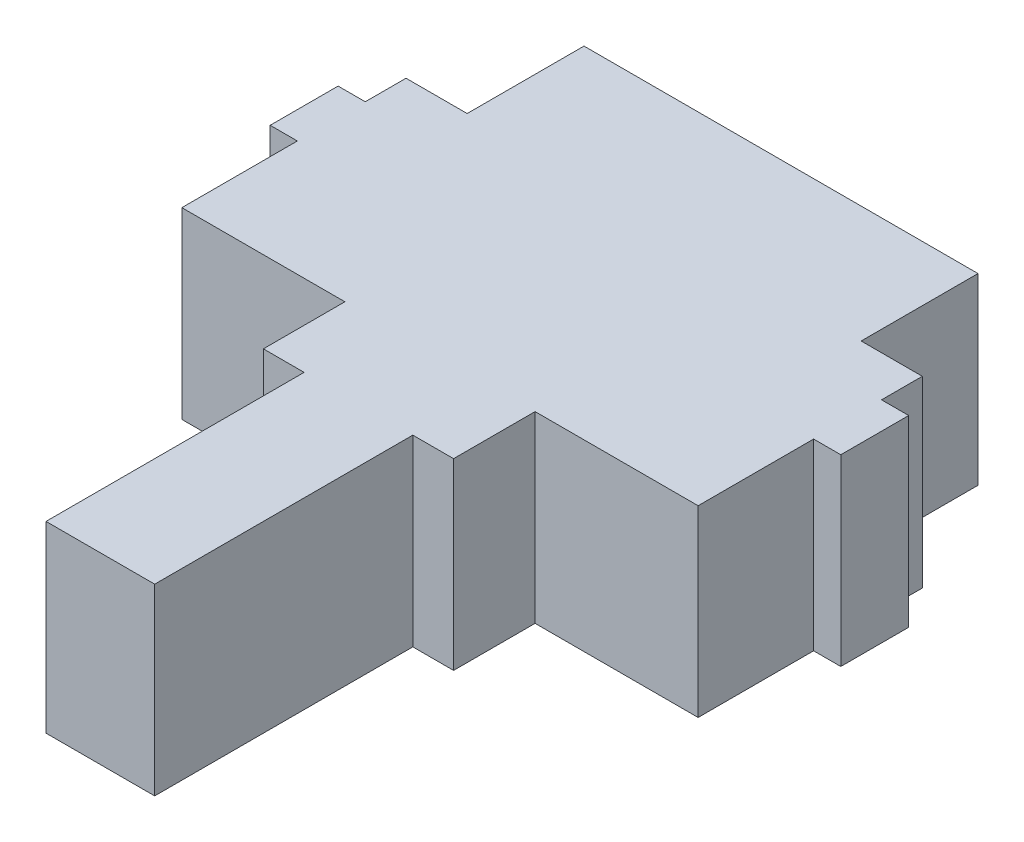
ISO-10303-21;
HEADER;
FILE_DESCRIPTION(('STEP AP214'),'2;1');
FILE_NAME('part.step','',(''),(''),'','','');
FILE_SCHEMA(('AUTOMOTIVE_DESIGN { 1 0 10303 214 1 1 1 1 }'));
ENDSEC;
DATA;
#1=APPLICATION_CONTEXT('core data for automotive mechanical design processes');
#2=APPLICATION_PROTOCOL_DEFINITION('international standard','automotive_design',2000,#1);
#3=PRODUCT_CONTEXT('',#1,'mechanical');
#4=PRODUCT('Part','Part','',(#3));
#5=PRODUCT_RELATED_PRODUCT_CATEGORY('part','',(#4));
#6=PRODUCT_DEFINITION_FORMATION('','',#4);
#7=PRODUCT_DEFINITION_CONTEXT('part definition',#1,'design');
#8=PRODUCT_DEFINITION('design','',#6,#7);
#9=PRODUCT_DEFINITION_SHAPE('','',#8);
#10=(LENGTH_UNIT() NAMED_UNIT(*) SI_UNIT(.MILLI.,.METRE.));
#11=(NAMED_UNIT(*) PLANE_ANGLE_UNIT() SI_UNIT($,.RADIAN.));
#12=(NAMED_UNIT(*) SI_UNIT($,.STERADIAN.) SOLID_ANGLE_UNIT());
#13=UNCERTAINTY_MEASURE_WITH_UNIT(LENGTH_MEASURE(1.E-05),#10,'distance_accuracy_value','');
#14=(GEOMETRIC_REPRESENTATION_CONTEXT(3) GLOBAL_UNCERTAINTY_ASSIGNED_CONTEXT((#13)) GLOBAL_UNIT_ASSIGNED_CONTEXT((#10,
#11,#12)) REPRESENTATION_CONTEXT('',''));
#15=CARTESIAN_POINT('',(0.,0.,0.));
#16=DIRECTION('',(0.,0.,1.));
#17=DIRECTION('',(1.,0.,0.));
#18=AXIS2_PLACEMENT_3D('',#15,#16,#17);
#19=CARTESIAN_POINT('',(0.,13.5,-54.5939349107113));
#20=DIRECTION('',(0.,0.,-1.));
#21=DIRECTION('',(-1.,0.,0.));
#22=AXIS2_PLACEMENT_3D('',#19,#20,#21);
#23=PLANE('',#22);
#24=DIRECTION('',(1.,0.,0.));
#25=VECTOR('',#24,1.);
#26=CARTESIAN_POINT('',(0.,0.,-54.5939349107113));
#27=LINE('',#26,#25);
#28=CARTESIAN_POINT('',(19.5666079787848,0.,-54.5939349107113));
#29=VERTEX_POINT('',#28);
#30=CARTESIAN_POINT('',(48.5666079787848,0.,-54.5939349107113));
#31=VERTEX_POINT('',#30);
#32=EDGE_CURVE('E223',#29,#31,#27,.T.);
#33=ORIENTED_EDGE('',*,*,#32,.F.);
#34=DIRECTION('',(0.,-1.,0.));
#35=VECTOR('',#34,1.);
#36=CARTESIAN_POINT('',(19.5666079787848,13.5,-54.5939349107113));
#37=LINE('',#36,#35);
#38=CARTESIAN_POINT('',(19.5666079787848,13.5,-54.5939349107113));
#39=VERTEX_POINT('',#38);
#40=EDGE_CURVE('E43',#39,#29,#37,.T.);
#41=ORIENTED_EDGE('',*,*,#40,.F.);
#42=DIRECTION('',(1.,0.,0.));
#43=VECTOR('',#42,1.);
#44=CARTESIAN_POINT('',(0.,13.5,-54.5939349107113));
#45=LINE('',#44,#43);
#46=CARTESIAN_POINT('',(48.5666079787848,13.5,-54.5939349107113));
#47=VERTEX_POINT('',#46);
#48=EDGE_CURVE('E285',#39,#47,#45,.T.);
#49=ORIENTED_EDGE('',*,*,#48,.T.);
#50=DIRECTION('',(0.,-1.,0.));
#51=VECTOR('',#50,1.);
#52=CARTESIAN_POINT('',(48.5666079787848,13.5,-54.5939349107113));
#53=LINE('',#52,#51);
#54=EDGE_CURVE('E135',#47,#31,#53,.T.);
#55=ORIENTED_EDGE('',*,*,#54,.T.);
#56=EDGE_LOOP('',(#33,#41,#49,#55));
#57=FACE_BOUND('',#56,.T.);
#58=ADVANCED_FACE('F35',(#57),#23,.T.);
#59=CARTESIAN_POINT('',(19.5666079787848,13.5,0.));
#60=DIRECTION('',(-1.,0.,0.));
#61=DIRECTION('',(0.,0.,1.));
#62=AXIS2_PLACEMENT_3D('',#59,#60,#61);
#63=PLANE('',#62);
#64=DIRECTION('',(0.,0.,-1.));
#65=VECTOR('',#64,1.);
#66=CARTESIAN_POINT('',(19.5666079787848,0.,0.));
#67=LINE('',#66,#65);
#68=CARTESIAN_POINT('',(19.5666079787848,0.,-45.9939349107113));
#69=VERTEX_POINT('',#68);
#70=EDGE_CURVE('E226',#69,#29,#67,.T.);
#71=ORIENTED_EDGE('',*,*,#70,.F.);
#72=DIRECTION('',(0.,-1.,0.));
#73=VECTOR('',#72,1.);
#74=CARTESIAN_POINT('',(19.5666079787848,13.5,-45.9939349107113));
#75=LINE('',#74,#73);
#76=CARTESIAN_POINT('',(19.5666079787848,13.5,-45.9939349107113));
#77=VERTEX_POINT('',#76);
#78=EDGE_CURVE('E331',#77,#69,#75,.T.);
#79=ORIENTED_EDGE('',*,*,#78,.F.);
#80=DIRECTION('',(0.,0.,-1.));
#81=VECTOR('',#80,1.);
#82=CARTESIAN_POINT('',(19.5666079787848,13.5,0.));
#83=LINE('',#82,#81);
#84=EDGE_CURVE('E337',#77,#39,#83,.T.);
#85=ORIENTED_EDGE('',*,*,#84,.T.);
#86=ORIENTED_EDGE('',*,*,#40,.T.);
#87=EDGE_LOOP('',(#71,#79,#85,#86));
#88=FACE_BOUND('',#87,.T.);
#89=ADVANCED_FACE('F335',(#88),#63,.T.);
#90=CARTESIAN_POINT('',(1.41843126474952E-13,13.5,-45.9939349107114));
#91=DIRECTION('',(0.,0.,-1.));
#92=DIRECTION('',(-1.,0.,0.));
#93=AXIS2_PLACEMENT_3D('',#90,#91,#92);
#94=PLANE('',#93);
#95=DIRECTION('',(1.,0.,0.));
#96=VECTOR('',#95,1.);
#97=CARTESIAN_POINT('',(1.41843126474952E-13,0.,-45.9939349107114));
#98=LINE('',#97,#96);
#99=CARTESIAN_POINT('',(15.0666079787848,0.,-45.9939349107113));
#100=VERTEX_POINT('',#99);
#101=EDGE_CURVE('E230',#100,#69,#98,.T.);
#102=ORIENTED_EDGE('',*,*,#101,.F.);
#103=DIRECTION('',(0.,-1.,0.));
#104=VECTOR('',#103,1.);
#105=CARTESIAN_POINT('',(15.0666079787848,13.5,-45.9939349107113));
#106=LINE('',#105,#104);
#107=CARTESIAN_POINT('',(15.0666079787848,13.5,-45.9939349107113));
#108=VERTEX_POINT('',#107);
#109=EDGE_CURVE('E329',#108,#100,#106,.T.);
#110=ORIENTED_EDGE('',*,*,#109,.F.);
#111=DIRECTION('',(1.,0.,0.));
#112=VECTOR('',#111,1.);
#113=CARTESIAN_POINT('',(1.41843126474952E-13,13.5,-45.9939349107114));
#114=LINE('',#113,#112);
#115=EDGE_CURVE('E348',#108,#77,#114,.T.);
#116=ORIENTED_EDGE('',*,*,#115,.T.);
#117=ORIENTED_EDGE('',*,*,#78,.T.);
#118=EDGE_LOOP('',(#102,#110,#116,#117));
#119=FACE_BOUND('',#118,.T.);
#120=ADVANCED_FACE('F345',(#119),#94,.T.);
#121=CARTESIAN_POINT('',(15.0666079787848,13.5,0.));
#122=DIRECTION('',(-1.,0.,0.));
#123=DIRECTION('',(0.,0.,1.));
#124=AXIS2_PLACEMENT_3D('',#121,#122,#123);
#125=PLANE('',#124);
#126=DIRECTION('',(0.,0.,-1.));
#127=VECTOR('',#126,1.);
#128=CARTESIAN_POINT('',(15.0666079787848,0.,0.));
#129=LINE('',#128,#127);
#130=CARTESIAN_POINT('',(15.0666079787848,0.,-42.9939349107113));
#131=VERTEX_POINT('',#130);
#132=EDGE_CURVE('E233',#131,#100,#129,.T.);
#133=ORIENTED_EDGE('',*,*,#132,.F.);
#134=DIRECTION('',(0.,-1.,0.));
#135=VECTOR('',#134,1.);
#136=CARTESIAN_POINT('',(15.0666079787848,13.5,-42.9939349107113));
#137=LINE('',#136,#135);
#138=CARTESIAN_POINT('',(15.0666079787848,13.5,-42.9939349107113));
#139=VERTEX_POINT('',#138);
#140=EDGE_CURVE('E327',#139,#131,#137,.T.);
#141=ORIENTED_EDGE('',*,*,#140,.F.);
#142=DIRECTION('',(0.,0.,-1.));
#143=VECTOR('',#142,1.);
#144=CARTESIAN_POINT('',(15.0666079787848,13.5,0.));
#145=LINE('',#144,#143);
#146=EDGE_CURVE('E352',#139,#108,#145,.T.);
#147=ORIENTED_EDGE('',*,*,#146,.T.);
#148=ORIENTED_EDGE('',*,*,#109,.T.);
#149=EDGE_LOOP('',(#133,#141,#147,#148));
#150=FACE_BOUND('',#149,.T.);
#151=ADVANCED_FACE('F419',(#150),#125,.T.);
#152=CARTESIAN_POINT('',(2.98330352856919E-13,13.5,-42.9939349107114));
#153=DIRECTION('',(0.,0.,1.));
#154=DIRECTION('',(1.,0.,0.));
#155=AXIS2_PLACEMENT_3D('',#152,#153,#154);
#156=PLANE('',#155);
#157=DIRECTION('',(-1.,0.,0.));
#158=VECTOR('',#157,1.);
#159=CARTESIAN_POINT('',(2.98330352856919E-13,0.,-42.9939349107114));
#160=LINE('',#159,#158);
#161=CARTESIAN_POINT('',(13.0666079787848,0.,-42.9939349107113));
#162=VERTEX_POINT('',#161);
#163=EDGE_CURVE('E236',#131,#162,#160,.T.);
#164=ORIENTED_EDGE('',*,*,#163,.T.);
#165=DIRECTION('',(0.,-1.,0.));
#166=VECTOR('',#165,1.);
#167=CARTESIAN_POINT('',(13.0666079787848,13.5,-42.9939349107113));
#168=LINE('',#167,#166);
#169=CARTESIAN_POINT('',(13.0666079787848,13.5,-42.9939349107113));
#170=VERTEX_POINT('',#169);
#171=EDGE_CURVE('E325',#170,#162,#168,.T.);
#172=ORIENTED_EDGE('',*,*,#171,.F.);
#173=DIRECTION('',(-1.,0.,0.));
#174=VECTOR('',#173,1.);
#175=CARTESIAN_POINT('',(2.98330352856919E-13,13.5,-42.9939349107114));
#176=LINE('',#175,#174);
#177=EDGE_CURVE('E358',#139,#170,#176,.T.);
#178=ORIENTED_EDGE('',*,*,#177,.F.);
#179=ORIENTED_EDGE('',*,*,#140,.T.);
#180=EDGE_LOOP('',(#164,#172,#178,#179));
#181=FACE_BOUND('',#180,.T.);
#182=ADVANCED_FACE('F424',(#181),#156,.F.);
#183=CARTESIAN_POINT('',(13.0666079787848,13.5,0.));
#184=DIRECTION('',(-1.,0.,0.));
#185=DIRECTION('',(0.,0.,1.));
#186=AXIS2_PLACEMENT_3D('',#183,#184,#185);
#187=PLANE('',#186);
#188=DIRECTION('',(0.,0.,-1.));
#189=VECTOR('',#188,1.);
#190=CARTESIAN_POINT('',(13.0666079787848,0.,0.));
#191=LINE('',#190,#189);
#192=CARTESIAN_POINT('',(13.0666079787848,0.,-37.9939349107113));
#193=VERTEX_POINT('',#192);
#194=EDGE_CURVE('E239',#193,#162,#191,.T.);
#195=ORIENTED_EDGE('',*,*,#194,.F.);
#196=DIRECTION('',(0.,-1.,0.));
#197=VECTOR('',#196,1.);
#198=CARTESIAN_POINT('',(13.0666079787848,13.5,-37.9939349107113));
#199=LINE('',#198,#197);
#200=CARTESIAN_POINT('',(13.0666079787848,13.5,-37.9939349107113));
#201=VERTEX_POINT('',#200);
#202=EDGE_CURVE('E323',#201,#193,#199,.T.);
#203=ORIENTED_EDGE('',*,*,#202,.F.);
#204=DIRECTION('',(0.,0.,-1.));
#205=VECTOR('',#204,1.);
#206=CARTESIAN_POINT('',(13.0666079787848,13.5,0.));
#207=LINE('',#206,#205);
#208=EDGE_CURVE('E360',#201,#170,#207,.T.);
#209=ORIENTED_EDGE('',*,*,#208,.T.);
#210=ORIENTED_EDGE('',*,*,#171,.T.);
#211=EDGE_LOOP('',(#195,#203,#209,#210));
#212=FACE_BOUND('',#211,.T.);
#213=ADVANCED_FACE('F428',(#212),#187,.T.);
#214=CARTESIAN_POINT('',(0.,13.5,-37.9939349107113));
#215=DIRECTION('',(0.,0.,1.));
#216=DIRECTION('',(1.,0.,0.));
#217=AXIS2_PLACEMENT_3D('',#214,#215,#216);
#218=PLANE('',#217);
#219=DIRECTION('',(-1.,0.,0.));
#220=VECTOR('',#219,1.);
#221=CARTESIAN_POINT('',(0.,0.,-37.9939349107113));
#222=LINE('',#221,#220);
#223=CARTESIAN_POINT('',(15.0666079787848,0.,-37.9939349107113));
#224=VERTEX_POINT('',#223);
#225=EDGE_CURVE('E242',#224,#193,#222,.T.);
#226=ORIENTED_EDGE('',*,*,#225,.F.);
#227=DIRECTION('',(0.,-1.,0.));
#228=VECTOR('',#227,1.);
#229=CARTESIAN_POINT('',(15.0666079787848,13.5,-37.9939349107113));
#230=LINE('',#229,#228);
#231=CARTESIAN_POINT('',(15.0666079787848,13.5,-37.9939349107113));
#232=VERTEX_POINT('',#231);
#233=EDGE_CURVE('E321',#232,#224,#230,.T.);
#234=ORIENTED_EDGE('',*,*,#233,.F.);
#235=DIRECTION('',(-1.,0.,0.));
#236=VECTOR('',#235,1.);
#237=CARTESIAN_POINT('',(0.,13.5,-37.9939349107113));
#238=LINE('',#237,#236);
#239=EDGE_CURVE('E363',#232,#201,#238,.T.);
#240=ORIENTED_EDGE('',*,*,#239,.T.);
#241=ORIENTED_EDGE('',*,*,#202,.T.);
#242=EDGE_LOOP('',(#226,#234,#240,#241));
#243=FACE_BOUND('',#242,.T.);
#244=ADVANCED_FACE('F432',(#243),#218,.T.);
#245=CARTESIAN_POINT('',(15.0666079787848,13.5,0.));
#246=DIRECTION('',(-1.,0.,0.));
#247=DIRECTION('',(0.,0.,1.));
#248=AXIS2_PLACEMENT_3D('',#245,#246,#247);
#249=PLANE('',#248);
#250=DIRECTION('',(0.,0.,-1.));
#251=VECTOR('',#250,1.);
#252=CARTESIAN_POINT('',(15.0666079787848,0.,0.));
#253=LINE('',#252,#251);
#254=CARTESIAN_POINT('',(15.0666079787848,0.,-29.4939349107113));
#255=VERTEX_POINT('',#254);
#256=EDGE_CURVE('E245',#255,#224,#253,.T.);
#257=ORIENTED_EDGE('',*,*,#256,.F.);
#258=DIRECTION('',(0.,-1.,0.));
#259=VECTOR('',#258,1.);
#260=CARTESIAN_POINT('',(15.0666079787848,13.5,-29.4939349107113));
#261=LINE('',#260,#259);
#262=CARTESIAN_POINT('',(15.0666079787848,13.5,-29.4939349107113));
#263=VERTEX_POINT('',#262);
#264=EDGE_CURVE('E319',#263,#255,#261,.T.);
#265=ORIENTED_EDGE('',*,*,#264,.F.);
#266=DIRECTION('',(0.,0.,-1.));
#267=VECTOR('',#266,1.);
#268=CARTESIAN_POINT('',(15.0666079787848,13.5,0.));
#269=LINE('',#268,#267);
#270=EDGE_CURVE('E366',#263,#232,#269,.T.);
#271=ORIENTED_EDGE('',*,*,#270,.T.);
#272=ORIENTED_EDGE('',*,*,#233,.T.);
#273=EDGE_LOOP('',(#257,#265,#271,#272));
#274=FACE_BOUND('',#273,.T.);
#275=ADVANCED_FACE('F436',(#274),#249,.T.);
#276=CARTESIAN_POINT('',(0.,13.5,-29.4939349107113));
#277=DIRECTION('',(0.,0.,1.));
#278=DIRECTION('',(1.,0.,0.));
#279=AXIS2_PLACEMENT_3D('',#276,#277,#278);
#280=PLANE('',#279);
#281=DIRECTION('',(-1.,0.,0.));
#282=VECTOR('',#281,1.);
#283=CARTESIAN_POINT('',(0.,0.,-29.4939349107113));
#284=LINE('',#283,#282);
#285=CARTESIAN_POINT('',(27.0666079787848,0.,-29.4939349107113));
#286=VERTEX_POINT('',#285);
#287=EDGE_CURVE('E248',#286,#255,#284,.T.);
#288=ORIENTED_EDGE('',*,*,#287,.F.);
#289=DIRECTION('',(0.,-1.,0.));
#290=VECTOR('',#289,1.);
#291=CARTESIAN_POINT('',(27.0666079787848,13.5,-29.4939349107113));
#292=LINE('',#291,#290);
#293=CARTESIAN_POINT('',(27.0666079787848,13.5,-29.4939349107113));
#294=VERTEX_POINT('',#293);
#295=EDGE_CURVE('E317',#294,#286,#292,.T.);
#296=ORIENTED_EDGE('',*,*,#295,.F.);
#297=DIRECTION('',(-1.,0.,0.));
#298=VECTOR('',#297,1.);
#299=CARTESIAN_POINT('',(0.,13.5,-29.4939349107113));
#300=LINE('',#299,#298);
#301=EDGE_CURVE('E369',#294,#263,#300,.T.);
#302=ORIENTED_EDGE('',*,*,#301,.T.);
#303=ORIENTED_EDGE('',*,*,#264,.T.);
#304=EDGE_LOOP('',(#288,#296,#302,#303));
#305=FACE_BOUND('',#304,.T.);
#306=ADVANCED_FACE('F440',(#305),#280,.T.);
#307=CARTESIAN_POINT('',(27.0666079787848,13.5,0.));
#308=DIRECTION('',(-1.,0.,0.));
#309=DIRECTION('',(0.,0.,1.));
#310=AXIS2_PLACEMENT_3D('',#307,#308,#309);
#311=PLANE('',#310);
#312=DIRECTION('',(0.,0.,-1.));
#313=VECTOR('',#312,1.);
#314=CARTESIAN_POINT('',(27.0666079787848,0.,0.));
#315=LINE('',#314,#313);
#316=CARTESIAN_POINT('',(27.0666079787848,0.,-23.4939349107113));
#317=VERTEX_POINT('',#316);
#318=EDGE_CURVE('E251',#317,#286,#315,.T.);
#319=ORIENTED_EDGE('',*,*,#318,.F.);
#320=DIRECTION('',(0.,-1.,0.));
#321=VECTOR('',#320,1.);
#322=CARTESIAN_POINT('',(27.0666079787848,13.5,-23.4939349107113));
#323=LINE('',#322,#321);
#324=CARTESIAN_POINT('',(27.0666079787848,13.5,-23.4939349107113));
#325=VERTEX_POINT('',#324);
#326=EDGE_CURVE('E315',#325,#317,#323,.T.);
#327=ORIENTED_EDGE('',*,*,#326,.F.);
#328=DIRECTION('',(0.,0.,-1.));
#329=VECTOR('',#328,1.);
#330=CARTESIAN_POINT('',(27.0666079787848,13.5,0.));
#331=LINE('',#330,#329);
#332=EDGE_CURVE('E372',#325,#294,#331,.T.);
#333=ORIENTED_EDGE('',*,*,#332,.T.);
#334=ORIENTED_EDGE('',*,*,#295,.T.);
#335=EDGE_LOOP('',(#319,#327,#333,#334));
#336=FACE_BOUND('',#335,.T.);
#337=ADVANCED_FACE('F444',(#336),#311,.T.);
#338=CARTESIAN_POINT('',(0.,13.5,-23.4939349107113));
#339=DIRECTION('',(0.,0.,1.));
#340=DIRECTION('',(1.,0.,0.));
#341=AXIS2_PLACEMENT_3D('',#338,#339,#340);
#342=PLANE('',#341);
#343=DIRECTION('',(-1.,0.,0.));
#344=VECTOR('',#343,1.);
#345=CARTESIAN_POINT('',(0.,0.,-23.4939349107113));
#346=LINE('',#345,#344);
#347=CARTESIAN_POINT('',(30.0666079787848,0.,-23.4939349107113));
#348=VERTEX_POINT('',#347);
#349=EDGE_CURVE('E254',#348,#317,#346,.T.);
#350=ORIENTED_EDGE('',*,*,#349,.F.);
#351=DIRECTION('',(0.,-1.,0.));
#352=VECTOR('',#351,1.);
#353=CARTESIAN_POINT('',(30.0666079787848,13.5,-23.4939349107113));
#354=LINE('',#353,#352);
#355=CARTESIAN_POINT('',(30.0666079787848,13.5,-23.4939349107113));
#356=VERTEX_POINT('',#355);
#357=EDGE_CURVE('E313',#356,#348,#354,.T.);
#358=ORIENTED_EDGE('',*,*,#357,.F.);
#359=DIRECTION('',(-1.,0.,0.));
#360=VECTOR('',#359,1.);
#361=CARTESIAN_POINT('',(0.,13.5,-23.4939349107113));
#362=LINE('',#361,#360);
#363=EDGE_CURVE('E375',#356,#325,#362,.T.);
#364=ORIENTED_EDGE('',*,*,#363,.T.);
#365=ORIENTED_EDGE('',*,*,#326,.T.);
#366=EDGE_LOOP('',(#350,#358,#364,#365));
#367=FACE_BOUND('',#366,.T.);
#368=ADVANCED_FACE('F448',(#367),#342,.T.);
#369=CARTESIAN_POINT('',(30.0666079787848,13.5,0.));
#370=DIRECTION('',(1.,0.,0.));
#371=DIRECTION('',(0.,0.,-1.));
#372=AXIS2_PLACEMENT_3D('',#369,#370,#371);
#373=PLANE('',#372);
#374=DIRECTION('',(0.,0.,1.));
#375=VECTOR('',#374,1.);
#376=CARTESIAN_POINT('',(30.0666079787848,0.,0.));
#377=LINE('',#376,#375);
#378=CARTESIAN_POINT('',(30.0666079787848,0.,-4.49393491071132));
#379=VERTEX_POINT('',#378);
#380=EDGE_CURVE('E257',#348,#379,#377,.T.);
#381=ORIENTED_EDGE('',*,*,#380,.T.);
#382=DIRECTION('',(0.,-1.,0.));
#383=VECTOR('',#382,1.);
#384=CARTESIAN_POINT('',(30.0666079787848,13.5,-4.49393491071132));
#385=LINE('',#384,#383);
#386=CARTESIAN_POINT('',(30.0666079787848,13.5,-4.49393491071132));
#387=VERTEX_POINT('',#386);
#388=EDGE_CURVE('E310',#387,#379,#385,.T.);
#389=ORIENTED_EDGE('',*,*,#388,.F.);
#390=DIRECTION('',(0.,0.,1.));
#391=VECTOR('',#390,1.);
#392=CARTESIAN_POINT('',(30.0666079787848,13.5,0.));
#393=LINE('',#392,#391);
#394=EDGE_CURVE('E378',#356,#387,#393,.T.);
#395=ORIENTED_EDGE('',*,*,#394,.F.);
#396=ORIENTED_EDGE('',*,*,#357,.T.);
#397=EDGE_LOOP('',(#381,#389,#395,#396));
#398=FACE_BOUND('',#397,.T.);
#399=ADVANCED_FACE('F452',(#398),#373,.F.);
#400=CARTESIAN_POINT('',(0.,13.5,-4.49393491071132));
#401=DIRECTION('',(0.,0.,-1.));
#402=DIRECTION('',(-1.,0.,0.));
#403=AXIS2_PLACEMENT_3D('',#400,#401,#402);
#404=PLANE('',#403);
#405=DIRECTION('',(1.,0.,0.));
#406=VECTOR('',#405,1.);
#407=CARTESIAN_POINT('',(0.,0.,-4.49393491071132));
#408=LINE('',#407,#406);
#409=CARTESIAN_POINT('',(38.0666079787848,0.,-4.49393491071132));
#410=VERTEX_POINT('',#409);
#411=EDGE_CURVE('E259',#379,#410,#408,.T.);
#412=ORIENTED_EDGE('',*,*,#411,.T.);
#413=DIRECTION('',(0.,-1.,0.));
#414=VECTOR('',#413,1.);
#415=CARTESIAN_POINT('',(38.0666079787848,13.5,-4.49393491071132));
#416=LINE('',#415,#414);
#417=CARTESIAN_POINT('',(38.0666079787848,13.5,-4.49393491071132));
#418=VERTEX_POINT('',#417);
#419=EDGE_CURVE('E308',#418,#410,#416,.T.);
#420=ORIENTED_EDGE('',*,*,#419,.F.);
#421=DIRECTION('',(1.,0.,0.));
#422=VECTOR('',#421,1.);
#423=CARTESIAN_POINT('',(0.,13.5,-4.49393491071132));
#424=LINE('',#423,#422);
#425=EDGE_CURVE('E380',#387,#418,#424,.T.);
#426=ORIENTED_EDGE('',*,*,#425,.F.);
#427=ORIENTED_EDGE('',*,*,#388,.T.);
#428=EDGE_LOOP('',(#412,#420,#426,#427));
#429=FACE_BOUND('',#428,.T.);
#430=ADVANCED_FACE('F456',(#429),#404,.F.);
#431=CARTESIAN_POINT('',(38.0666079787848,13.5,0.));
#432=DIRECTION('',(1.,0.,0.));
#433=DIRECTION('',(0.,0.,-1.));
#434=AXIS2_PLACEMENT_3D('',#431,#432,#433);
#435=PLANE('',#434);
#436=DIRECTION('',(0.,0.,1.));
#437=VECTOR('',#436,1.);
#438=CARTESIAN_POINT('',(38.0666079787848,0.,0.));
#439=LINE('',#438,#437);
#440=CARTESIAN_POINT('',(38.0666079787848,0.,-23.4939349107113));
#441=VERTEX_POINT('',#440);
#442=EDGE_CURVE('E262',#441,#410,#439,.T.);
#443=ORIENTED_EDGE('',*,*,#442,.F.);
#444=DIRECTION('',(0.,-1.,0.));
#445=VECTOR('',#444,1.);
#446=CARTESIAN_POINT('',(38.0666079787848,13.5,-23.4939349107113));
#447=LINE('',#446,#445);
#448=CARTESIAN_POINT('',(38.0666079787848,13.5,-23.4939349107113));
#449=VERTEX_POINT('',#448);
#450=EDGE_CURVE('E306',#449,#441,#447,.T.);
#451=ORIENTED_EDGE('',*,*,#450,.F.);
#452=DIRECTION('',(0.,0.,1.));
#453=VECTOR('',#452,1.);
#454=CARTESIAN_POINT('',(38.0666079787848,13.5,0.));
#455=LINE('',#454,#453);
#456=EDGE_CURVE('E382',#449,#418,#455,.T.);
#457=ORIENTED_EDGE('',*,*,#456,.T.);
#458=ORIENTED_EDGE('',*,*,#419,.T.);
#459=EDGE_LOOP('',(#443,#451,#457,#458));
#460=FACE_BOUND('',#459,.T.);
#461=ADVANCED_FACE('F460',(#460),#435,.T.);
#462=CARTESIAN_POINT('',(0.,13.5,-23.4939349107113));
#463=DIRECTION('',(0.,0.,-1.));
#464=DIRECTION('',(-1.,0.,0.));
#465=AXIS2_PLACEMENT_3D('',#462,#463,#464);
#466=PLANE('',#465);
#467=DIRECTION('',(1.,0.,0.));
#468=VECTOR('',#467,1.);
#469=CARTESIAN_POINT('',(0.,0.,-23.4939349107113));
#470=LINE('',#469,#468);
#471=CARTESIAN_POINT('',(41.0666079787848,0.,-23.4939349107113));
#472=VERTEX_POINT('',#471);
#473=EDGE_CURVE('E265',#441,#472,#470,.T.);
#474=ORIENTED_EDGE('',*,*,#473,.T.);
#475=DIRECTION('',(0.,-1.,0.));
#476=VECTOR('',#475,1.);
#477=CARTESIAN_POINT('',(41.0666079787848,13.5,-23.4939349107113));
#478=LINE('',#477,#476);
#479=CARTESIAN_POINT('',(41.0666079787848,13.5,-23.4939349107113));
#480=VERTEX_POINT('',#479);
#481=EDGE_CURVE('E303',#480,#472,#478,.T.);
#482=ORIENTED_EDGE('',*,*,#481,.F.);
#483=DIRECTION('',(1.,0.,0.));
#484=VECTOR('',#483,1.);
#485=CARTESIAN_POINT('',(0.,13.5,-23.4939349107113));
#486=LINE('',#485,#484);
#487=EDGE_CURVE('E385',#449,#480,#486,.T.);
#488=ORIENTED_EDGE('',*,*,#487,.F.);
#489=ORIENTED_EDGE('',*,*,#450,.T.);
#490=EDGE_LOOP('',(#474,#482,#488,#489));
#491=FACE_BOUND('',#490,.T.);
#492=ADVANCED_FACE('F464',(#491),#466,.F.);
#493=CARTESIAN_POINT('',(41.0666079787848,13.5,0.));
#494=DIRECTION('',(-1.,0.,0.));
#495=DIRECTION('',(0.,0.,1.));
#496=AXIS2_PLACEMENT_3D('',#493,#494,#495);
#497=PLANE('',#496);
#498=DIRECTION('',(0.,0.,-1.));
#499=VECTOR('',#498,1.);
#500=CARTESIAN_POINT('',(41.0666079787848,0.,0.));
#501=LINE('',#500,#499);
#502=CARTESIAN_POINT('',(41.0666079787848,0.,-29.4939349107113));
#503=VERTEX_POINT('',#502);
#504=EDGE_CURVE('E267',#472,#503,#501,.T.);
#505=ORIENTED_EDGE('',*,*,#504,.T.);
#506=DIRECTION('',(0.,-1.,0.));
#507=VECTOR('',#506,1.);
#508=CARTESIAN_POINT('',(41.0666079787848,13.5,-29.4939349107113));
#509=LINE('',#508,#507);
#510=CARTESIAN_POINT('',(41.0666079787848,13.5,-29.4939349107113));
#511=VERTEX_POINT('',#510);
#512=EDGE_CURVE('E300',#511,#503,#509,.T.);
#513=ORIENTED_EDGE('',*,*,#512,.F.);
#514=DIRECTION('',(0.,0.,-1.));
#515=VECTOR('',#514,1.);
#516=CARTESIAN_POINT('',(41.0666079787848,13.5,0.));
#517=LINE('',#516,#515);
#518=EDGE_CURVE('E387',#480,#511,#517,.T.);
#519=ORIENTED_EDGE('',*,*,#518,.F.);
#520=ORIENTED_EDGE('',*,*,#481,.T.);
#521=EDGE_LOOP('',(#505,#513,#519,#520));
#522=FACE_BOUND('',#521,.T.);
#523=ADVANCED_FACE('F468',(#522),#497,.F.);
#524=CARTESIAN_POINT('',(0.,13.5,-29.4939349107113));
#525=DIRECTION('',(0.,0.,-1.));
#526=DIRECTION('',(-1.,0.,0.));
#527=AXIS2_PLACEMENT_3D('',#524,#525,#526);
#528=PLANE('',#527);
#529=DIRECTION('',(1.,0.,0.));
#530=VECTOR('',#529,1.);
#531=CARTESIAN_POINT('',(0.,0.,-29.4939349107113));
#532=LINE('',#531,#530);
#533=CARTESIAN_POINT('',(53.0666079787848,0.,-29.4939349107113));
#534=VERTEX_POINT('',#533);
#535=EDGE_CURVE('E269',#503,#534,#532,.T.);
#536=ORIENTED_EDGE('',*,*,#535,.T.);
#537=DIRECTION('',(0.,-1.,0.));
#538=VECTOR('',#537,1.);
#539=CARTESIAN_POINT('',(53.0666079787848,13.5,-29.4939349107113));
#540=LINE('',#539,#538);
#541=CARTESIAN_POINT('',(53.0666079787848,13.5,-29.4939349107113));
#542=VERTEX_POINT('',#541);
#543=EDGE_CURVE('E297',#542,#534,#540,.T.);
#544=ORIENTED_EDGE('',*,*,#543,.F.);
#545=DIRECTION('',(1.,0.,0.));
#546=VECTOR('',#545,1.);
#547=CARTESIAN_POINT('',(0.,13.5,-29.4939349107113));
#548=LINE('',#547,#546);
#549=EDGE_CURVE('E389',#511,#542,#548,.T.);
#550=ORIENTED_EDGE('',*,*,#549,.F.);
#551=ORIENTED_EDGE('',*,*,#512,.T.);
#552=EDGE_LOOP('',(#536,#544,#550,#551));
#553=FACE_BOUND('',#552,.T.);
#554=ADVANCED_FACE('F472',(#553),#528,.F.);
#555=CARTESIAN_POINT('',(53.0666079787848,13.5,0.));
#556=DIRECTION('',(-1.,0.,0.));
#557=DIRECTION('',(0.,0.,1.));
#558=AXIS2_PLACEMENT_3D('',#555,#556,#557);
#559=PLANE('',#558);
#560=DIRECTION('',(0.,0.,-1.));
#561=VECTOR('',#560,1.);
#562=CARTESIAN_POINT('',(53.0666079787848,0.,0.));
#563=LINE('',#562,#561);
#564=CARTESIAN_POINT('',(53.0666079787848,0.,-37.9939349107113));
#565=VERTEX_POINT('',#564);
#566=EDGE_CURVE('E271',#534,#565,#563,.T.);
#567=ORIENTED_EDGE('',*,*,#566,.T.);
#568=DIRECTION('',(0.,-1.,0.));
#569=VECTOR('',#568,1.);
#570=CARTESIAN_POINT('',(53.0666079787848,13.5,-37.9939349107113));
#571=LINE('',#570,#569);
#572=CARTESIAN_POINT('',(53.0666079787848,13.5,-37.9939349107113));
#573=VERTEX_POINT('',#572);
#574=EDGE_CURVE('E294',#573,#565,#571,.T.);
#575=ORIENTED_EDGE('',*,*,#574,.F.);
#576=DIRECTION('',(0.,0.,-1.));
#577=VECTOR('',#576,1.);
#578=CARTESIAN_POINT('',(53.0666079787848,13.5,0.));
#579=LINE('',#578,#577);
#580=EDGE_CURVE('E391',#542,#573,#579,.T.);
#581=ORIENTED_EDGE('',*,*,#580,.F.);
#582=ORIENTED_EDGE('',*,*,#543,.T.);
#583=EDGE_LOOP('',(#567,#575,#581,#582));
#584=FACE_BOUND('',#583,.T.);
#585=ADVANCED_FACE('F476',(#584),#559,.F.);
#586=CARTESIAN_POINT('',(0.,13.5,-37.9939349107113));
#587=DIRECTION('',(0.,0.,-1.));
#588=DIRECTION('',(-1.,0.,0.));
#589=AXIS2_PLACEMENT_3D('',#586,#587,#588);
#590=PLANE('',#589);
#591=DIRECTION('',(1.,0.,0.));
#592=VECTOR('',#591,1.);
#593=CARTESIAN_POINT('',(0.,0.,-37.9939349107113));
#594=LINE('',#593,#592);
#595=CARTESIAN_POINT('',(55.0666079787848,0.,-37.9939349107113));
#596=VERTEX_POINT('',#595);
#597=EDGE_CURVE('E273',#565,#596,#594,.T.);
#598=ORIENTED_EDGE('',*,*,#597,.T.);
#599=DIRECTION('',(0.,-1.,0.));
#600=VECTOR('',#599,1.);
#601=CARTESIAN_POINT('',(55.0666079787848,13.5,-37.9939349107113));
#602=LINE('',#601,#600);
#603=CARTESIAN_POINT('',(55.0666079787848,13.5,-37.9939349107113));
#604=VERTEX_POINT('',#603);
#605=EDGE_CURVE('E291',#604,#596,#602,.T.);
#606=ORIENTED_EDGE('',*,*,#605,.F.);
#607=DIRECTION('',(1.,0.,0.));
#608=VECTOR('',#607,1.);
#609=CARTESIAN_POINT('',(0.,13.5,-37.9939349107113));
#610=LINE('',#609,#608);
#611=EDGE_CURVE('E393',#573,#604,#610,.T.);
#612=ORIENTED_EDGE('',*,*,#611,.F.);
#613=ORIENTED_EDGE('',*,*,#574,.T.);
#614=EDGE_LOOP('',(#598,#606,#612,#613));
#615=FACE_BOUND('',#614,.T.);
#616=ADVANCED_FACE('F480',(#615),#590,.F.);
#617=CARTESIAN_POINT('',(55.0666079787848,13.5,0.));
#618=DIRECTION('',(-1.,0.,0.));
#619=DIRECTION('',(0.,0.,1.));
#620=AXIS2_PLACEMENT_3D('',#617,#618,#619);
#621=PLANE('',#620);
#622=DIRECTION('',(0.,0.,-1.));
#623=VECTOR('',#622,1.);
#624=CARTESIAN_POINT('',(55.0666079787848,0.,0.));
#625=LINE('',#624,#623);
#626=CARTESIAN_POINT('',(55.0666079787848,0.,-42.9939349107113));
#627=VERTEX_POINT('',#626);
#628=EDGE_CURVE('E275',#596,#627,#625,.T.);
#629=ORIENTED_EDGE('',*,*,#628,.T.);
#630=DIRECTION('',(0.,-1.,0.));
#631=VECTOR('',#630,1.);
#632=CARTESIAN_POINT('',(55.0666079787848,13.5,-42.9939349107113));
#633=LINE('',#632,#631);
#634=CARTESIAN_POINT('',(55.0666079787848,13.5,-42.9939349107113));
#635=VERTEX_POINT('',#634);
#636=EDGE_CURVE('E289',#635,#627,#633,.T.);
#637=ORIENTED_EDGE('',*,*,#636,.F.);
#638=DIRECTION('',(0.,0.,-1.));
#639=VECTOR('',#638,1.);
#640=CARTESIAN_POINT('',(55.0666079787848,13.5,0.));
#641=LINE('',#640,#639);
#642=EDGE_CURVE('E395',#604,#635,#641,.T.);
#643=ORIENTED_EDGE('',*,*,#642,.F.);
#644=ORIENTED_EDGE('',*,*,#605,.T.);
#645=EDGE_LOOP('',(#629,#637,#643,#644));
#646=FACE_BOUND('',#645,.T.);
#647=ADVANCED_FACE('F484',(#646),#621,.F.);
#648=CARTESIAN_POINT('',(-1.4916517642846E-13,13.5,-42.9939349107111));
#649=DIRECTION('',(0.,0.,-1.));
#650=DIRECTION('',(-1.,0.,0.));
#651=AXIS2_PLACEMENT_3D('',#648,#649,#650);
#652=PLANE('',#651);
#653=DIRECTION('',(1.,0.,0.));
#654=VECTOR('',#653,1.);
#655=CARTESIAN_POINT('',(-1.4916517642846E-13,0.,-42.9939349107111));
#656=LINE('',#655,#654);
#657=CARTESIAN_POINT('',(53.0666079787848,0.,-42.9939349107113));
#658=VERTEX_POINT('',#657);
#659=EDGE_CURVE('E278',#658,#627,#656,.T.);
#660=ORIENTED_EDGE('',*,*,#659,.F.);
#661=DIRECTION('',(0.,-1.,0.));
#662=VECTOR('',#661,1.);
#663=CARTESIAN_POINT('',(53.0666079787848,13.5,-42.9939349107113));
#664=LINE('',#663,#662);
#665=CARTESIAN_POINT('',(53.0666079787848,13.5,-42.9939349107113));
#666=VERTEX_POINT('',#665);
#667=EDGE_CURVE('E215',#666,#658,#664,.T.);
#668=ORIENTED_EDGE('',*,*,#667,.F.);
#669=DIRECTION('',(1.,0.,0.));
#670=VECTOR('',#669,1.);
#671=CARTESIAN_POINT('',(-1.4916517642846E-13,13.5,-42.9939349107111));
#672=LINE('',#671,#670);
#673=EDGE_CURVE('E208',#666,#635,#672,.T.);
#674=ORIENTED_EDGE('',*,*,#673,.T.);
#675=ORIENTED_EDGE('',*,*,#636,.T.);
#676=EDGE_LOOP('',(#660,#668,#674,#675));
#677=FACE_BOUND('',#676,.T.);
#678=ADVANCED_FACE('F398',(#677),#652,.T.);
#679=CARTESIAN_POINT('',(53.0666079787848,13.5,0.));
#680=DIRECTION('',(-1.,0.,0.));
#681=DIRECTION('',(0.,0.,1.));
#682=AXIS2_PLACEMENT_3D('',#679,#680,#681);
#683=PLANE('',#682);
#684=DIRECTION('',(0.,0.,-1.));
#685=VECTOR('',#684,1.);
#686=CARTESIAN_POINT('',(53.0666079787848,0.,0.));
#687=LINE('',#686,#685);
#688=CARTESIAN_POINT('',(53.0666079787848,0.,-45.9939349107113));
#689=VERTEX_POINT('',#688);
#690=EDGE_CURVE('E214',#658,#689,#687,.T.);
#691=ORIENTED_EDGE('',*,*,#690,.T.);
#692=DIRECTION('',(0.,-1.,0.));
#693=VECTOR('',#692,1.);
#694=CARTESIAN_POINT('',(53.0666079787848,13.5,-45.9939349107113));
#695=LINE('',#694,#693);
#696=CARTESIAN_POINT('',(53.0666079787848,13.5,-45.9939349107113));
#697=VERTEX_POINT('',#696);
#698=EDGE_CURVE('E211',#697,#689,#695,.T.);
#699=ORIENTED_EDGE('',*,*,#698,.F.);
#700=DIRECTION('',(0.,0.,-1.));
#701=VECTOR('',#700,1.);
#702=CARTESIAN_POINT('',(53.0666079787848,13.5,0.));
#703=LINE('',#702,#701);
#704=EDGE_CURVE('E202',#666,#697,#703,.T.);
#705=ORIENTED_EDGE('',*,*,#704,.F.);
#706=ORIENTED_EDGE('',*,*,#667,.T.);
#707=EDGE_LOOP('',(#691,#699,#705,#706));
#708=FACE_BOUND('',#707,.T.);
#709=ADVANCED_FACE('F212',(#708),#683,.F.);
#710=CARTESIAN_POINT('',(0.,13.5,-45.9939349107114));
#711=DIRECTION('',(0.,0.,1.));
#712=DIRECTION('',(1.,0.,0.));
#713=AXIS2_PLACEMENT_3D('',#710,#711,#712);
#714=PLANE('',#713);
#715=DIRECTION('',(-1.,0.,0.));
#716=VECTOR('',#715,1.);
#717=CARTESIAN_POINT('',(0.,0.,-45.9939349107114));
#718=LINE('',#717,#716);
#719=CARTESIAN_POINT('',(48.5666079787848,0.,-45.9939349107113));
#720=VERTEX_POINT('',#719);
#721=EDGE_CURVE('E128',#689,#720,#718,.T.);
#722=ORIENTED_EDGE('',*,*,#721,.T.);
#723=DIRECTION('',(0.,-1.,0.));
#724=VECTOR('',#723,1.);
#725=CARTESIAN_POINT('',(48.5666079787848,13.5,-45.9939349107113));
#726=LINE('',#725,#724);
#727=CARTESIAN_POINT('',(48.5666079787848,13.5,-45.9939349107113));
#728=VERTEX_POINT('',#727);
#729=EDGE_CURVE('E216',#728,#720,#726,.T.);
#730=ORIENTED_EDGE('',*,*,#729,.F.);
#731=DIRECTION('',(-1.,0.,0.));
#732=VECTOR('',#731,1.);
#733=CARTESIAN_POINT('',(0.,13.5,-45.9939349107114));
#734=LINE('',#733,#732);
#735=EDGE_CURVE('E206',#697,#728,#734,.T.);
#736=ORIENTED_EDGE('',*,*,#735,.F.);
#737=ORIENTED_EDGE('',*,*,#698,.T.);
#738=EDGE_LOOP('',(#722,#730,#736,#737));
#739=FACE_BOUND('',#738,.T.);
#740=ADVANCED_FACE('F218',(#739),#714,.F.);
#741=CARTESIAN_POINT('',(48.5666079787847,13.5,0.));
#742=DIRECTION('',(-1.,0.,0.));
#743=DIRECTION('',(0.,0.,1.));
#744=AXIS2_PLACEMENT_3D('',#741,#742,#743);
#745=PLANE('',#744);
#746=DIRECTION('',(0.,0.,-1.));
#747=VECTOR('',#746,1.);
#748=CARTESIAN_POINT('',(48.5666079787847,0.,0.));
#749=LINE('',#748,#747);
#750=EDGE_CURVE('E283',#720,#31,#749,.T.);
#751=ORIENTED_EDGE('',*,*,#750,.T.);
#752=ORIENTED_EDGE('',*,*,#54,.F.);
#753=DIRECTION('',(0.,0.,-1.));
#754=VECTOR('',#753,1.);
#755=CARTESIAN_POINT('',(48.5666079787847,13.5,0.));
#756=LINE('',#755,#754);
#757=EDGE_CURVE('E51',#728,#47,#756,.T.);
#758=ORIENTED_EDGE('',*,*,#757,.F.);
#759=ORIENTED_EDGE('',*,*,#729,.T.);
#760=EDGE_LOOP('',(#751,#752,#758,#759));
#761=FACE_BOUND('',#760,.T.);
#762=ADVANCED_FACE('F402',(#761),#745,.F.);
#763=CARTESIAN_POINT('',(0.,13.5,0.));
#764=DIRECTION('',(0.,1.,0.));
#765=DIRECTION('',(0.,0.,1.));
#766=AXIS2_PLACEMENT_3D('',#763,#764,#765);
#767=PLANE('',#766);
#768=ORIENTED_EDGE('',*,*,#48,.F.);
#769=ORIENTED_EDGE('',*,*,#84,.F.);
#770=ORIENTED_EDGE('',*,*,#115,.F.);
#771=ORIENTED_EDGE('',*,*,#146,.F.);
#772=ORIENTED_EDGE('',*,*,#177,.T.);
#773=ORIENTED_EDGE('',*,*,#208,.F.);
#774=ORIENTED_EDGE('',*,*,#239,.F.);
#775=ORIENTED_EDGE('',*,*,#270,.F.);
#776=ORIENTED_EDGE('',*,*,#301,.F.);
#777=ORIENTED_EDGE('',*,*,#332,.F.);
#778=ORIENTED_EDGE('',*,*,#363,.F.);
#779=ORIENTED_EDGE('',*,*,#394,.T.);
#780=ORIENTED_EDGE('',*,*,#425,.T.);
#781=ORIENTED_EDGE('',*,*,#456,.F.);
#782=ORIENTED_EDGE('',*,*,#487,.T.);
#783=ORIENTED_EDGE('',*,*,#518,.T.);
#784=ORIENTED_EDGE('',*,*,#549,.T.);
#785=ORIENTED_EDGE('',*,*,#580,.T.);
#786=ORIENTED_EDGE('',*,*,#611,.T.);
#787=ORIENTED_EDGE('',*,*,#642,.T.);
#788=ORIENTED_EDGE('',*,*,#673,.F.);
#789=ORIENTED_EDGE('',*,*,#704,.T.);
#790=ORIENTED_EDGE('',*,*,#735,.T.);
#791=ORIENTED_EDGE('',*,*,#757,.T.);
#792=EDGE_LOOP('',(#768,#769,#770,#771,#772,#773,#774,#775,#776,#777,#778,#779,#780,#781,#782,
#783,#784,#785,#786,#787,#788,#789,#790,#791));
#793=FACE_BOUND('',#792,.T.);
#794=ADVANCED_FACE('F204',(#793),#767,.T.);
#795=CARTESIAN_POINT('',(0.,0.,0.));
#796=DIRECTION('',(0.,1.,0.));
#797=DIRECTION('',(0.,0.,1.));
#798=AXIS2_PLACEMENT_3D('',#795,#796,#797);
#799=PLANE('',#798);
#800=CARTESIAN_POINT('',(34.0666079787848,0.,-32.9939349107113));
#801=DIRECTION('',(0.,1.,0.));
#802=DIRECTION('',(0.,0.,1.));
#803=AXIS2_PLACEMENT_3D('',#800,#801,#802);
#804=CIRCLE('',#803,2.5);
#805=CARTESIAN_POINT('',(34.0666079787848,0.,-30.4939349107113));
#806=VERTEX_POINT('',#805);
#807=EDGE_CURVE('E11',#806,#806,#804,.F.);
#808=ORIENTED_EDGE('',*,*,#807,.F.);
#809=EDGE_LOOP('',(#808));
#810=FACE_BOUND('',#809,.T.);
#811=ORIENTED_EDGE('',*,*,#32,.T.);
#812=ORIENTED_EDGE('',*,*,#750,.F.);
#813=ORIENTED_EDGE('',*,*,#721,.F.);
#814=ORIENTED_EDGE('',*,*,#690,.F.);
#815=ORIENTED_EDGE('',*,*,#659,.T.);
#816=ORIENTED_EDGE('',*,*,#628,.F.);
#817=ORIENTED_EDGE('',*,*,#597,.F.);
#818=ORIENTED_EDGE('',*,*,#566,.F.);
#819=ORIENTED_EDGE('',*,*,#535,.F.);
#820=ORIENTED_EDGE('',*,*,#504,.F.);
#821=ORIENTED_EDGE('',*,*,#473,.F.);
#822=ORIENTED_EDGE('',*,*,#442,.T.);
#823=ORIENTED_EDGE('',*,*,#411,.F.);
#824=ORIENTED_EDGE('',*,*,#380,.F.);
#825=ORIENTED_EDGE('',*,*,#349,.T.);
#826=ORIENTED_EDGE('',*,*,#318,.T.);
#827=ORIENTED_EDGE('',*,*,#287,.T.);
#828=ORIENTED_EDGE('',*,*,#256,.T.);
#829=ORIENTED_EDGE('',*,*,#225,.T.);
#830=ORIENTED_EDGE('',*,*,#194,.T.);
#831=ORIENTED_EDGE('',*,*,#163,.F.);
#832=ORIENTED_EDGE('',*,*,#132,.T.);
#833=ORIENTED_EDGE('',*,*,#101,.T.);
#834=ORIENTED_EDGE('',*,*,#70,.T.);
#835=EDGE_LOOP('',(#811,#812,#813,#814,#815,#816,#817,#818,#819,#820,#821,#822,#823,#824,#825,
#826,#827,#828,#829,#830,#831,#832,#833,#834));
#836=FACE_BOUND('',#835,.T.);
#837=ADVANCED_FACE('F340',(#810,#836),#799,.F.);
#838=CARTESIAN_POINT('',(34.0666079787848,-2.5,-32.9939349107113));
#839=DIRECTION('',(0.,1.,0.));
#840=DIRECTION('',(0.,0.,1.));
#841=AXIS2_PLACEMENT_3D('',#838,#839,#840);
#842=CYLINDRICAL_SURFACE('',#841,2.5);
#843=CARTESIAN_POINT('',(34.0666079787848,-2.5,-32.9939349107113));
#844=DIRECTION('',(0.,-1.,0.));
#845=DIRECTION('',(0.,0.,-1.));
#846=AXIS2_PLACEMENT_3D('',#843,#844,#845);
#847=CIRCLE('',#846,2.5);
#848=CARTESIAN_POINT('',(34.0666079787848,-2.5,-35.4939349107113));
#849=VERTEX_POINT('',#848);
#850=EDGE_CURVE('E227',#849,#849,#847,.T.);
#851=ORIENTED_EDGE('',*,*,#850,.F.);
#852=EDGE_LOOP('',(#851));
#853=FACE_BOUND('',#852,.T.);
#854=ORIENTED_EDGE('',*,*,#807,.T.);
#855=EDGE_LOOP('',(#854));
#856=FACE_BOUND('',#855,.T.);
#857=ADVANCED_FACE('F519',(#853,#856),#842,.T.);
#858=CARTESIAN_POINT('',(34.0666079787848,-2.5,-32.9939349107113));
#859=DIRECTION('',(0.,-1.,0.));
#860=DIRECTION('',(0.,0.,-1.));
#861=AXIS2_PLACEMENT_3D('',#858,#859,#860);
#862=PLANE('',#861);
#863=ORIENTED_EDGE('',*,*,#850,.T.);
#864=EDGE_LOOP('',(#863));
#865=FACE_BOUND('',#864,.T.);
#866=ADVANCED_FACE('F528',(#865),#862,.T.);
#867=CLOSED_SHELL('',(#58,#89,#120,#151,#182,#213,#244,#275,#306,#337,#368,#399,#430,#461,#492,
#523,#554,#585,#616,#647,#678,#709,#740,#762,#794,#837,#857,#866));
#868=MANIFOLD_SOLID_BREP('B2',#867);
#869=ADVANCED_BREP_SHAPE_REPRESENTATION('',(#18,#868),#14);
#870=SHAPE_DEFINITION_REPRESENTATION(#9,#869);
ENDSEC;
END-ISO-10303-21;
